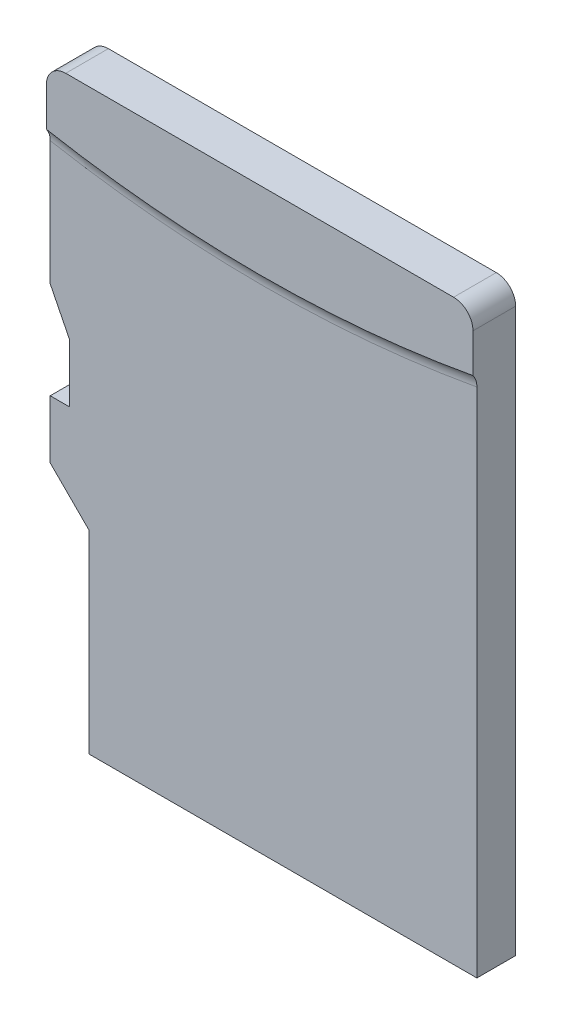
ISO-10303-21;
HEADER;
FILE_DESCRIPTION(('STEP AP214'),'2;1');
FILE_NAME('part.step','',(''),(''),'','','');
FILE_SCHEMA(('AUTOMOTIVE_DESIGN { 1 0 10303 214 1 1 1 1 }'));
ENDSEC;
DATA;
#1=APPLICATION_CONTEXT('core data for automotive mechanical design processes');
#2=APPLICATION_PROTOCOL_DEFINITION('international standard','automotive_design',2000,#1);
#3=PRODUCT_CONTEXT('',#1,'mechanical');
#4=PRODUCT('Part','Part','',(#3));
#5=PRODUCT_RELATED_PRODUCT_CATEGORY('part','',(#4));
#6=PRODUCT_DEFINITION_FORMATION('','',#4);
#7=PRODUCT_DEFINITION_CONTEXT('part definition',#1,'design');
#8=PRODUCT_DEFINITION('design','',#6,#7);
#9=PRODUCT_DEFINITION_SHAPE('','',#8);
#10=(LENGTH_UNIT() NAMED_UNIT(*) SI_UNIT(.MILLI.,.METRE.));
#11=(NAMED_UNIT(*) PLANE_ANGLE_UNIT() SI_UNIT($,.RADIAN.));
#12=(NAMED_UNIT(*) SI_UNIT($,.STERADIAN.) SOLID_ANGLE_UNIT());
#13=UNCERTAINTY_MEASURE_WITH_UNIT(LENGTH_MEASURE(1.E-05),#10,'distance_accuracy_value','');
#14=(GEOMETRIC_REPRESENTATION_CONTEXT(3) GLOBAL_UNCERTAINTY_ASSIGNED_CONTEXT((#13)) GLOBAL_UNIT_ASSIGNED_CONTEXT((#10,
#11,#12)) REPRESENTATION_CONTEXT('',''));
#15=CARTESIAN_POINT('',(0.,0.,0.));
#16=DIRECTION('',(0.,0.,1.));
#17=DIRECTION('',(1.,0.,0.));
#18=AXIS2_PLACEMENT_3D('',#15,#16,#17);
#19=CARTESIAN_POINT('',(-5.,0.,1.));
#20=DIRECTION('',(-1.,0.,0.));
#21=DIRECTION('',(0.,0.,1.));
#22=AXIS2_PLACEMENT_3D('',#19,#20,#21);
#23=PLANE('',#22);
#24=DIRECTION('',(0.,1.,0.));
#25=VECTOR('',#24,1.);
#26=CARTESIAN_POINT('',(-5.,0.,0.));
#27=LINE('',#26,#25);
#28=CARTESIAN_POINT('',(-5.,0.,0.));
#29=VERTEX_POINT('',#28);
#30=CARTESIAN_POINT('',(-5.,1.5,0.));
#31=VERTEX_POINT('',#30);
#32=EDGE_CURVE('E164',#29,#31,#27,.T.);
#33=ORIENTED_EDGE('',*,*,#32,.F.);
#34=DIRECTION('',(0.,0.,-1.));
#35=VECTOR('',#34,1.);
#36=CARTESIAN_POINT('',(-5.,0.,1.));
#37=LINE('',#36,#35);
#38=CARTESIAN_POINT('',(-5.,0.,1.));
#39=VERTEX_POINT('',#38);
#40=EDGE_CURVE('E230',#39,#29,#37,.T.);
#41=ORIENTED_EDGE('',*,*,#40,.F.);
#42=DIRECTION('',(0.,1.,0.));
#43=VECTOR('',#42,1.);
#44=CARTESIAN_POINT('',(-5.,0.,1.));
#45=LINE('',#44,#43);
#46=CARTESIAN_POINT('',(-5.,1.5,1.));
#47=VERTEX_POINT('',#46);
#48=EDGE_CURVE('E165',#39,#47,#45,.T.);
#49=ORIENTED_EDGE('',*,*,#48,.T.);
#50=DIRECTION('',(0.,0.,-1.));
#51=VECTOR('',#50,1.);
#52=CARTESIAN_POINT('',(-5.,1.5,1.));
#53=LINE('',#52,#51);
#54=EDGE_CURVE('E189',#47,#31,#53,.T.);
#55=ORIENTED_EDGE('',*,*,#54,.T.);
#56=EDGE_LOOP('',(#33,#41,#49,#55));
#57=FACE_BOUND('',#56,.T.);
#58=ADVANCED_FACE('F37',(#57),#23,.T.);
#59=CARTESIAN_POINT('',(0.,0.,1.));
#60=DIRECTION('',(0.,1.,0.));
#61=DIRECTION('',(-1.,0.,0.));
#62=AXIS2_PLACEMENT_3D('',#59,#60,#61);
#63=PLANE('',#62);
#64=DIRECTION('',(1.,0.,0.));
#65=VECTOR('',#64,1.);
#66=CARTESIAN_POINT('',(0.,0.,0.));
#67=LINE('',#66,#65);
#68=CARTESIAN_POINT('',(-5.5,0.,0.));
#69=VERTEX_POINT('',#68);
#70=EDGE_CURVE('E192',#69,#29,#67,.T.);
#71=ORIENTED_EDGE('',*,*,#70,.F.);
#72=DIRECTION('',(0.,0.,-1.));
#73=VECTOR('',#72,1.);
#74=CARTESIAN_POINT('',(-5.5,0.,1.));
#75=LINE('',#74,#73);
#76=CARTESIAN_POINT('',(-5.5,0.,1.));
#77=VERTEX_POINT('',#76);
#78=EDGE_CURVE('E228',#77,#69,#75,.T.);
#79=ORIENTED_EDGE('',*,*,#78,.F.);
#80=DIRECTION('',(1.,0.,0.));
#81=VECTOR('',#80,1.);
#82=CARTESIAN_POINT('',(0.,0.,1.));
#83=LINE('',#82,#81);
#84=EDGE_CURVE('E168',#77,#39,#83,.T.);
#85=ORIENTED_EDGE('',*,*,#84,.T.);
#86=ORIENTED_EDGE('',*,*,#40,.T.);
#87=EDGE_LOOP('',(#71,#79,#85,#86));
#88=FACE_BOUND('',#87,.T.);
#89=ADVANCED_FACE('F262',(#88),#63,.T.);
#90=CARTESIAN_POINT('',(-5.5,0.,1.));
#91=DIRECTION('',(-1.,0.,0.));
#92=DIRECTION('',(0.,0.,1.));
#93=AXIS2_PLACEMENT_3D('',#90,#91,#92);
#94=PLANE('',#93);
#95=DIRECTION('',(0.,1.,0.));
#96=VECTOR('',#95,1.);
#97=CARTESIAN_POINT('',(-5.5,0.,0.));
#98=LINE('',#97,#96);
#99=CARTESIAN_POINT('',(-5.5,-1.5,0.));
#100=VERTEX_POINT('',#99);
#101=EDGE_CURVE('E195',#100,#69,#98,.T.);
#102=ORIENTED_EDGE('',*,*,#101,.F.);
#103=DIRECTION('',(0.,0.,-1.));
#104=VECTOR('',#103,1.);
#105=CARTESIAN_POINT('',(-5.5,-1.5,1.));
#106=LINE('',#105,#104);
#107=CARTESIAN_POINT('',(-5.5,-1.5,1.));
#108=VERTEX_POINT('',#107);
#109=EDGE_CURVE('E226',#108,#100,#106,.T.);
#110=ORIENTED_EDGE('',*,*,#109,.F.);
#111=DIRECTION('',(0.,1.,0.));
#112=VECTOR('',#111,1.);
#113=CARTESIAN_POINT('',(-5.5,0.,1.));
#114=LINE('',#113,#112);
#115=EDGE_CURVE('E172',#108,#77,#114,.T.);
#116=ORIENTED_EDGE('',*,*,#115,.T.);
#117=ORIENTED_EDGE('',*,*,#78,.T.);
#118=EDGE_LOOP('',(#102,#110,#116,#117));
#119=FACE_BOUND('',#118,.T.);
#120=ADVANCED_FACE('F267',(#119),#94,.T.);
#121=CARTESIAN_POINT('',(-3.5,-3.5,1.));
#122=DIRECTION('',(0.707106781186548,0.707106781186547,0.));
#123=DIRECTION('',(-0.707106781186547,0.707106781186548,0.));
#124=AXIS2_PLACEMENT_3D('',#121,#122,#123);
#125=PLANE('',#124);
#126=DIRECTION('',(0.707106781186547,-0.707106781186548,0.));
#127=VECTOR('',#126,1.);
#128=CARTESIAN_POINT('',(-3.5,-3.5,0.));
#129=LINE('',#128,#127);
#130=CARTESIAN_POINT('',(-4.5,-2.5,0.));
#131=VERTEX_POINT('',#130);
#132=EDGE_CURVE('E198',#100,#131,#129,.T.);
#133=ORIENTED_EDGE('',*,*,#132,.T.);
#134=DIRECTION('',(0.,0.,-1.));
#135=VECTOR('',#134,1.);
#136=CARTESIAN_POINT('',(-4.5,-2.5,1.));
#137=LINE('',#136,#135);
#138=CARTESIAN_POINT('',(-4.5,-2.5,1.));
#139=VERTEX_POINT('',#138);
#140=EDGE_CURVE('E224',#139,#131,#137,.T.);
#141=ORIENTED_EDGE('',*,*,#140,.F.);
#142=DIRECTION('',(0.707106781186547,-0.707106781186548,0.));
#143=VECTOR('',#142,1.);
#144=CARTESIAN_POINT('',(-3.5,-3.5,1.));
#145=LINE('',#144,#143);
#146=EDGE_CURVE('E175',#108,#139,#145,.T.);
#147=ORIENTED_EDGE('',*,*,#146,.F.);
#148=ORIENTED_EDGE('',*,*,#109,.T.);
#149=EDGE_LOOP('',(#133,#141,#147,#148));
#150=FACE_BOUND('',#149,.T.);
#151=ADVANCED_FACE('F286',(#150),#125,.F.);
#152=CARTESIAN_POINT('',(-4.5,0.,1.));
#153=DIRECTION('',(-1.,0.,0.));
#154=DIRECTION('',(0.,0.,1.));
#155=AXIS2_PLACEMENT_3D('',#152,#153,#154);
#156=PLANE('',#155);
#157=DIRECTION('',(0.,1.,0.));
#158=VECTOR('',#157,1.);
#159=CARTESIAN_POINT('',(-4.5,0.,0.));
#160=LINE('',#159,#158);
#161=CARTESIAN_POINT('',(-4.5,-7.5,0.));
#162=VERTEX_POINT('',#161);
#163=EDGE_CURVE('E201',#162,#131,#160,.T.);
#164=ORIENTED_EDGE('',*,*,#163,.F.);
#165=DIRECTION('',(0.,0.,-1.));
#166=VECTOR('',#165,1.);
#167=CARTESIAN_POINT('',(-4.5,-7.5,1.));
#168=LINE('',#167,#166);
#169=CARTESIAN_POINT('',(-4.5,-7.5,1.));
#170=VERTEX_POINT('',#169);
#171=EDGE_CURVE('E222',#170,#162,#168,.T.);
#172=ORIENTED_EDGE('',*,*,#171,.F.);
#173=DIRECTION('',(0.,1.,0.));
#174=VECTOR('',#173,1.);
#175=CARTESIAN_POINT('',(-4.5,0.,1.));
#176=LINE('',#175,#174);
#177=EDGE_CURVE('E177',#170,#139,#176,.T.);
#178=ORIENTED_EDGE('',*,*,#177,.T.);
#179=ORIENTED_EDGE('',*,*,#140,.T.);
#180=EDGE_LOOP('',(#164,#172,#178,#179));
#181=FACE_BOUND('',#180,.T.);
#182=ADVANCED_FACE('F292',(#181),#156,.T.);
#183=CARTESIAN_POINT('',(0.,-7.5,1.));
#184=DIRECTION('',(0.,1.,0.));
#185=DIRECTION('',(-1.,0.,0.));
#186=AXIS2_PLACEMENT_3D('',#183,#184,#185);
#187=PLANE('',#186);
#188=DIRECTION('',(1.,0.,0.));
#189=VECTOR('',#188,1.);
#190=CARTESIAN_POINT('',(0.,-7.5,0.));
#191=LINE('',#190,#189);
#192=CARTESIAN_POINT('',(5.5,-7.5,0.));
#193=VERTEX_POINT('',#192);
#194=EDGE_CURVE('E204',#162,#193,#191,.T.);
#195=ORIENTED_EDGE('',*,*,#194,.T.);
#196=DIRECTION('',(0.,0.,-1.));
#197=VECTOR('',#196,1.);
#198=CARTESIAN_POINT('',(5.5,-7.5,1.));
#199=LINE('',#198,#197);
#200=CARTESIAN_POINT('',(5.5,-7.5,1.));
#201=VERTEX_POINT('',#200);
#202=EDGE_CURVE('E219',#201,#193,#199,.T.);
#203=ORIENTED_EDGE('',*,*,#202,.F.);
#204=DIRECTION('',(1.,0.,0.));
#205=VECTOR('',#204,1.);
#206=CARTESIAN_POINT('',(0.,-7.5,1.));
#207=LINE('',#206,#205);
#208=EDGE_CURVE('E180',#170,#201,#207,.T.);
#209=ORIENTED_EDGE('',*,*,#208,.F.);
#210=ORIENTED_EDGE('',*,*,#171,.T.);
#211=EDGE_LOOP('',(#195,#203,#209,#210));
#212=FACE_BOUND('',#211,.T.);
#213=ADVANCED_FACE('F295',(#212),#187,.F.);
#214=CARTESIAN_POINT('',(5.5,0.,1.));
#215=DIRECTION('',(-1.,0.,0.));
#216=DIRECTION('',(0.,0.,1.));
#217=AXIS2_PLACEMENT_3D('',#214,#215,#216);
#218=PLANE('',#217);
#219=DIRECTION('',(0.,1.,0.));
#220=VECTOR('',#219,1.);
#221=CARTESIAN_POINT('',(5.5,0.,0.));
#222=LINE('',#221,#220);
#223=CARTESIAN_POINT('',(5.5,7.,0.));
#224=VERTEX_POINT('',#223);
#225=EDGE_CURVE('E206',#193,#224,#222,.T.);
#226=ORIENTED_EDGE('',*,*,#225,.T.);
#227=DIRECTION('',(0.,0.,-1.));
#228=VECTOR('',#227,1.);
#229=CARTESIAN_POINT('',(5.5,7.,1.1));
#230=LINE('',#229,#228);
#231=CARTESIAN_POINT('',(5.5,7.,1.1));
#232=VERTEX_POINT('',#231);
#233=EDGE_CURVE('E11',#224,#232,#230,.F.);
#234=ORIENTED_EDGE('',*,*,#233,.T.);
#235=DIRECTION('',(0.,1.,0.));
#236=VECTOR('',#235,1.);
#237=CARTESIAN_POINT('',(5.5,7.5,1.1));
#238=LINE('',#237,#236);
#239=CARTESIAN_POINT('',(5.5,6.,1.1));
#240=VERTEX_POINT('',#239);
#241=EDGE_CURVE('E150',#240,#232,#238,.T.);
#242=ORIENTED_EDGE('',*,*,#241,.F.);
#243=CARTESIAN_POINT('',(5.5,6.,1.1));
#244=CARTESIAN_POINT('',(5.5,5.97650063573741,1.08263485377892));
#245=CARTESIAN_POINT('',(5.5,5.95148433240569,1.06734195255238));
#246=CARTESIAN_POINT('',(5.5,5.89989833220501,1.04156068162524));
#247=CARTESIAN_POINT('',(5.5,5.87338582586311,1.03095788490481));
#248=CARTESIAN_POINT('',(5.5,5.82202723496221,1.01521801550407));
#249=CARTESIAN_POINT('',(5.5,5.79732649107984,1.0096022127457));
#250=CARTESIAN_POINT('',(5.5,5.74677835171684,1.00194390647914));
#251=CARTESIAN_POINT('',(5.5,5.72091765371335,0.999989071127612));
#252=CARTESIAN_POINT('',(5.5,5.695049909297,1.));
#253=B_SPLINE_CURVE_WITH_KNOTS('',3,(#243,#244,#245,#246,#247,#248,#249,#250,#251,#252),
.UNSPECIFIED.,.F.,.F.,(4,2,2,2,4),(0.,0.0875354932775821,0.17279839931371,0.24852370371568,
0.326040278156283),.UNSPECIFIED.);
#254=CARTESIAN_POINT('',(5.5,5.695049909297,1.));
#255=VERTEX_POINT('',#254);
#256=EDGE_CURVE('E140',#240,#255,#253,.T.);
#257=ORIENTED_EDGE('',*,*,#256,.T.);
#258=DIRECTION('',(0.,1.,0.));
#259=VECTOR('',#258,1.);
#260=CARTESIAN_POINT('',(5.5,0.,1.));
#261=LINE('',#260,#259);
#262=EDGE_CURVE('E182',#201,#255,#261,.T.);
#263=ORIENTED_EDGE('',*,*,#262,.F.);
#264=ORIENTED_EDGE('',*,*,#202,.T.);
#265=EDGE_LOOP('',(#226,#234,#242,#257,#263,#264));
#266=FACE_BOUND('',#265,.T.);
#267=ADVANCED_FACE('F151',(#266),#218,.F.);
#268=CARTESIAN_POINT('',(0.,7.5,1.));
#269=DIRECTION('',(0.,1.,0.));
#270=DIRECTION('',(0.,0.,1.));
#271=AXIS2_PLACEMENT_3D('',#268,#269,#270);
#272=PLANE('',#271);
#273=DIRECTION('',(1.,0.,0.));
#274=VECTOR('',#273,1.);
#275=CARTESIAN_POINT('',(0.,7.5,0.));
#276=LINE('',#275,#274);
#277=CARTESIAN_POINT('',(-5.,7.5,0.));
#278=VERTEX_POINT('',#277);
#279=CARTESIAN_POINT('',(5.,7.5,0.));
#280=VERTEX_POINT('',#279);
#281=EDGE_CURVE('E208',#278,#280,#276,.T.);
#282=ORIENTED_EDGE('',*,*,#281,.F.);
#283=DIRECTION('',(0.,0.,-1.));
#284=VECTOR('',#283,1.);
#285=CARTESIAN_POINT('',(-5.,7.5,1.));
#286=LINE('',#285,#284);
#287=CARTESIAN_POINT('',(-5.,7.5,1.1));
#288=VERTEX_POINT('',#287);
#289=EDGE_CURVE('E58',#278,#288,#286,.F.);
#290=ORIENTED_EDGE('',*,*,#289,.T.);
#291=DIRECTION('',(-1.,0.,0.));
#292=VECTOR('',#291,1.);
#293=CARTESIAN_POINT('',(-5.5,7.5,1.1));
#294=LINE('',#293,#292);
#295=CARTESIAN_POINT('',(5.,7.5,1.1));
#296=VERTEX_POINT('',#295);
#297=EDGE_CURVE('E154',#296,#288,#294,.T.);
#298=ORIENTED_EDGE('',*,*,#297,.F.);
#299=DIRECTION('',(0.,0.,-1.));
#300=VECTOR('',#299,1.);
#301=CARTESIAN_POINT('',(5.,7.5,0.));
#302=LINE('',#301,#300);
#303=EDGE_CURVE('E310',#296,#280,#302,.T.);
#304=ORIENTED_EDGE('',*,*,#303,.T.);
#305=EDGE_LOOP('',(#282,#290,#298,#304));
#306=FACE_BOUND('',#305,.T.);
#307=ADVANCED_FACE('F315',(#306),#272,.T.);
#308=CARTESIAN_POINT('',(-5.5,0.,1.));
#309=DIRECTION('',(-1.,0.,0.));
#310=DIRECTION('',(0.,0.,1.));
#311=AXIS2_PLACEMENT_3D('',#308,#309,#310);
#312=PLANE('',#311);
#313=DIRECTION('',(0.,-1.,0.));
#314=VECTOR('',#313,1.);
#315=CARTESIAN_POINT('',(-5.5,6.,1.1));
#316=LINE('',#315,#314);
#317=CARTESIAN_POINT('',(-5.5,7.,1.1));
#318=VERTEX_POINT('',#317);
#319=CARTESIAN_POINT('',(-5.5,6.,1.1));
#320=VERTEX_POINT('',#319);
#321=EDGE_CURVE('E158',#318,#320,#316,.T.);
#322=ORIENTED_EDGE('',*,*,#321,.F.);
#323=DIRECTION('',(0.,0.,-1.));
#324=VECTOR('',#323,1.);
#325=CARTESIAN_POINT('',(-5.5,7.,1.));
#326=LINE('',#325,#324);
#327=CARTESIAN_POINT('',(-5.5,7.,0.));
#328=VERTEX_POINT('',#327);
#329=EDGE_CURVE('E302',#318,#328,#326,.T.);
#330=ORIENTED_EDGE('',*,*,#329,.T.);
#331=DIRECTION('',(0.,1.,0.));
#332=VECTOR('',#331,1.);
#333=CARTESIAN_POINT('',(-5.5,0.,0.));
#334=LINE('',#333,#332);
#335=CARTESIAN_POINT('',(-5.5,2.5,0.));
#336=VERTEX_POINT('',#335);
#337=EDGE_CURVE('E211',#336,#328,#334,.T.);
#338=ORIENTED_EDGE('',*,*,#337,.F.);
#339=DIRECTION('',(0.,0.,-1.));
#340=VECTOR('',#339,1.);
#341=CARTESIAN_POINT('',(-5.5,2.5,1.));
#342=LINE('',#341,#340);
#343=CARTESIAN_POINT('',(-5.5,2.5,1.));
#344=VERTEX_POINT('',#343);
#345=EDGE_CURVE('E217',#344,#336,#342,.T.);
#346=ORIENTED_EDGE('',*,*,#345,.F.);
#347=DIRECTION('',(0.,1.,0.));
#348=VECTOR('',#347,1.);
#349=CARTESIAN_POINT('',(-5.5,0.,1.));
#350=LINE('',#349,#348);
#351=CARTESIAN_POINT('',(-5.5,5.695049909297,1.));
#352=VERTEX_POINT('',#351);
#353=EDGE_CURVE('E184',#344,#352,#350,.T.);
#354=ORIENTED_EDGE('',*,*,#353,.T.);
#355=CARTESIAN_POINT('',(-5.5,5.695049909297,1.));
#356=CARTESIAN_POINT('',(-5.5,5.72436750732029,0.999976586331013));
#357=CARTESIAN_POINT('',(-5.5,5.75368457041806,1.00249564248165));
#358=CARTESIAN_POINT('',(-5.5,5.81071775781903,1.01231858178544));
#359=CARTESIAN_POINT('',(-5.5,5.83845569329613,1.01949601977295));
#360=CARTESIAN_POINT('',(-5.5,5.88915612149189,1.03723907565928));
#361=CARTESIAN_POINT('',(-5.5,5.91229525378397,1.0473031231664));
#362=CARTESIAN_POINT('',(-5.5,5.95737309470962,1.07099123872585));
#363=CARTESIAN_POINT('',(-5.5,5.97927063487811,1.08469365189551));
#364=CARTESIAN_POINT('',(-5.5,6.,1.1));
#365=B_SPLINE_CURVE_WITH_KNOTS('',3,(#355,#356,#357,#358,#359,#360,#361,#362,#363,#364),
.UNSPECIFIED.,.F.,.F.,(4,2,2,2,4),(0.,0.0878462064891744,0.173402393496485,0.248832216715334,
0.326040567801513),.UNSPECIFIED.);
#366=EDGE_CURVE('E148',#352,#320,#365,.T.);
#367=ORIENTED_EDGE('',*,*,#366,.T.);
#368=EDGE_LOOP('',(#322,#330,#338,#346,#354,#367));
#369=FACE_BOUND('',#368,.T.);
#370=ADVANCED_FACE('F299',(#369),#312,.T.);
#371=CARTESIAN_POINT('',(-3.4,-1.7,1.));
#372=DIRECTION('',(0.894427190999916,0.447213595499958,0.));
#373=DIRECTION('',(-0.447213595499958,0.894427190999916,0.));
#374=AXIS2_PLACEMENT_3D('',#371,#372,#373);
#375=PLANE('',#374);
#376=DIRECTION('',(0.447213595499958,-0.894427190999916,0.));
#377=VECTOR('',#376,1.);
#378=CARTESIAN_POINT('',(-3.4,-1.7,0.));
#379=LINE('',#378,#377);
#380=EDGE_CURVE('E169',#336,#31,#379,.T.);
#381=ORIENTED_EDGE('',*,*,#380,.T.);
#382=ORIENTED_EDGE('',*,*,#54,.F.);
#383=DIRECTION('',(0.447213595499958,-0.894427190999916,0.));
#384=VECTOR('',#383,1.);
#385=CARTESIAN_POINT('',(-3.4,-1.7,1.));
#386=LINE('',#385,#384);
#387=EDGE_CURVE('E187',#344,#47,#386,.T.);
#388=ORIENTED_EDGE('',*,*,#387,.F.);
#389=ORIENTED_EDGE('',*,*,#345,.T.);
#390=EDGE_LOOP('',(#381,#382,#388,#389));
#391=FACE_BOUND('',#390,.T.);
#392=ADVANCED_FACE('F322',(#391),#375,.F.);
#393=CARTESIAN_POINT('',(0.,0.,1.));
#394=DIRECTION('',(0.,0.,1.));
#395=DIRECTION('',(1.,0.,0.));
#396=AXIS2_PLACEMENT_3D('',#393,#394,#395);
#397=PLANE('',#396);
#398=ORIENTED_EDGE('',*,*,#262,.T.);
#399=CARTESIAN_POINT('',(0.,36.,1.));
#400=DIRECTION('',(0.,0.,1.));
#401=DIRECTION('',(1.,0.,0.));
#402=AXIS2_PLACEMENT_3D('',#399,#400,#401);
#403=CIRCLE('',#402,30.8000000000001);
#404=EDGE_CURVE('E145',#255,#352,#403,.F.);
#405=ORIENTED_EDGE('',*,*,#404,.T.);
#406=ORIENTED_EDGE('',*,*,#353,.F.);
#407=ORIENTED_EDGE('',*,*,#387,.T.);
#408=ORIENTED_EDGE('',*,*,#48,.F.);
#409=ORIENTED_EDGE('',*,*,#84,.F.);
#410=ORIENTED_EDGE('',*,*,#115,.F.);
#411=ORIENTED_EDGE('',*,*,#146,.T.);
#412=ORIENTED_EDGE('',*,*,#177,.F.);
#413=ORIENTED_EDGE('',*,*,#208,.T.);
#414=EDGE_LOOP('',(#398,#405,#406,#407,#408,#409,#410,#411,#412,#413));
#415=FACE_BOUND('',#414,.T.);
#416=ADVANCED_FACE('F281',(#415),#397,.T.);
#417=CARTESIAN_POINT('',(0.,0.,0.));
#418=DIRECTION('',(0.,0.,1.));
#419=DIRECTION('',(1.,0.,0.));
#420=AXIS2_PLACEMENT_3D('',#417,#418,#419);
#421=PLANE('',#420);
#422=ORIENTED_EDGE('',*,*,#337,.T.);
#423=CARTESIAN_POINT('',(-5.,7.,0.));
#424=DIRECTION('',(0.,0.,1.));
#425=DIRECTION('',(1.,0.,0.));
#426=AXIS2_PLACEMENT_3D('',#423,#424,#425);
#427=CIRCLE('',#426,0.5);
#428=EDGE_CURVE('E306',#328,#278,#427,.F.);
#429=ORIENTED_EDGE('',*,*,#428,.T.);
#430=ORIENTED_EDGE('',*,*,#281,.T.);
#431=CARTESIAN_POINT('',(5.,7.,0.));
#432=DIRECTION('',(0.,0.,1.));
#433=DIRECTION('',(1.,0.,0.));
#434=AXIS2_PLACEMENT_3D('',#431,#432,#433);
#435=CIRCLE('',#434,0.5);
#436=EDGE_CURVE('E304',#280,#224,#435,.F.);
#437=ORIENTED_EDGE('',*,*,#436,.T.);
#438=ORIENTED_EDGE('',*,*,#225,.F.);
#439=ORIENTED_EDGE('',*,*,#194,.F.);
#440=ORIENTED_EDGE('',*,*,#163,.T.);
#441=ORIENTED_EDGE('',*,*,#132,.F.);
#442=ORIENTED_EDGE('',*,*,#101,.T.);
#443=ORIENTED_EDGE('',*,*,#70,.T.);
#444=ORIENTED_EDGE('',*,*,#32,.T.);
#445=ORIENTED_EDGE('',*,*,#380,.F.);
#446=EDGE_LOOP('',(#422,#429,#430,#437,#438,#439,#440,#441,#442,#443,#444,#445));
#447=FACE_BOUND('',#446,.T.);
#448=ADVANCED_FACE('F275',(#447),#421,.F.);
#449=CARTESIAN_POINT('',(0.,36.,1.1));
#450=DIRECTION('',(0.,0.,1.));
#451=DIRECTION('',(1.,0.,0.));
#452=AXIS2_PLACEMENT_3D('',#449,#450,#451);
#453=PLANE('',#452);
#454=ORIENTED_EDGE('',*,*,#297,.T.);
#455=CARTESIAN_POINT('',(-5.,7.,1.1));
#456=DIRECTION('',(0.,0.,1.));
#457=DIRECTION('',(1.,0.,0.));
#458=AXIS2_PLACEMENT_3D('',#455,#456,#457);
#459=CIRCLE('',#458,0.5);
#460=EDGE_CURVE('E45',#288,#318,#459,.T.);
#461=ORIENTED_EDGE('',*,*,#460,.T.);
#462=ORIENTED_EDGE('',*,*,#321,.T.);
#463=CARTESIAN_POINT('',(0.,36.,1.1));
#464=DIRECTION('',(0.,0.,1.));
#465=DIRECTION('',(1.,0.,0.));
#466=AXIS2_PLACEMENT_3D('',#463,#464,#465);
#467=CIRCLE('',#466,30.5);
#468=EDGE_CURVE('E144',#320,#240,#467,.T.);
#469=ORIENTED_EDGE('',*,*,#468,.T.);
#470=ORIENTED_EDGE('',*,*,#241,.T.);
#471=CARTESIAN_POINT('',(5.,7.,1.1));
#472=DIRECTION('',(0.,0.,1.));
#473=DIRECTION('',(1.,0.,0.));
#474=AXIS2_PLACEMENT_3D('',#471,#472,#473);
#475=CIRCLE('',#474,0.5);
#476=EDGE_CURVE('E314',#232,#296,#475,.T.);
#477=ORIENTED_EDGE('',*,*,#476,.T.);
#478=EDGE_LOOP('',(#454,#461,#462,#469,#470,#477));
#479=FACE_BOUND('',#478,.T.);
#480=ADVANCED_FACE('F156',(#479),#453,.T.);
#481=CARTESIAN_POINT('',(0.,36.,1.5));
#482=DIRECTION('',(0.,0.,1.));
#483=DIRECTION('',(1.,0.,0.));
#484=AXIS2_PLACEMENT_3D('',#481,#482,#483);
#485=TOROIDAL_SURFACE('',#484,30.8000000000001,0.5);
#486=ORIENTED_EDGE('',*,*,#366,.F.);
#487=ORIENTED_EDGE('',*,*,#404,.F.);
#488=ORIENTED_EDGE('',*,*,#256,.F.);
#489=ORIENTED_EDGE('',*,*,#468,.F.);
#490=EDGE_LOOP('',(#486,#487,#488,#489));
#491=FACE_BOUND('',#490,.T.);
#492=ADVANCED_FACE('F142',(#491),#485,.F.);
#493=CARTESIAN_POINT('',(-5.,7.,1.));
#494=DIRECTION('',(0.,0.,-1.));
#495=DIRECTION('',(-1.,0.,0.));
#496=AXIS2_PLACEMENT_3D('',#493,#494,#495);
#497=CYLINDRICAL_SURFACE('',#496,0.5);
#498=ORIENTED_EDGE('',*,*,#460,.F.);
#499=ORIENTED_EDGE('',*,*,#289,.F.);
#500=ORIENTED_EDGE('',*,*,#428,.F.);
#501=ORIENTED_EDGE('',*,*,#329,.F.);
#502=EDGE_LOOP('',(#498,#499,#500,#501));
#503=FACE_BOUND('',#502,.T.);
#504=ADVANCED_FACE('F251',(#503),#497,.T.);
#505=CARTESIAN_POINT('',(5.,7.,1.));
#506=DIRECTION('',(0.,0.,1.));
#507=DIRECTION('',(1.,0.,0.));
#508=AXIS2_PLACEMENT_3D('',#505,#506,#507);
#509=CYLINDRICAL_SURFACE('',#508,0.5);
#510=ORIENTED_EDGE('',*,*,#476,.F.);
#511=ORIENTED_EDGE('',*,*,#233,.F.);
#512=ORIENTED_EDGE('',*,*,#436,.F.);
#513=ORIENTED_EDGE('',*,*,#303,.F.);
#514=EDGE_LOOP('',(#510,#511,#512,#513));
#515=FACE_BOUND('',#514,.T.);
#516=ADVANCED_FACE('F39',(#515),#509,.T.);
#517=CLOSED_SHELL('',(#58,#89,#120,#151,#182,#213,#267,#307,#370,#392,#416,#448,#480,#492,#504,#516));
#518=MANIFOLD_SOLID_BREP('B2',#517);
#519=ADVANCED_BREP_SHAPE_REPRESENTATION('',(#18,#518),#14);
#520=SHAPE_DEFINITION_REPRESENTATION(#9,#519);
ENDSEC;
END-ISO-10303-21;
